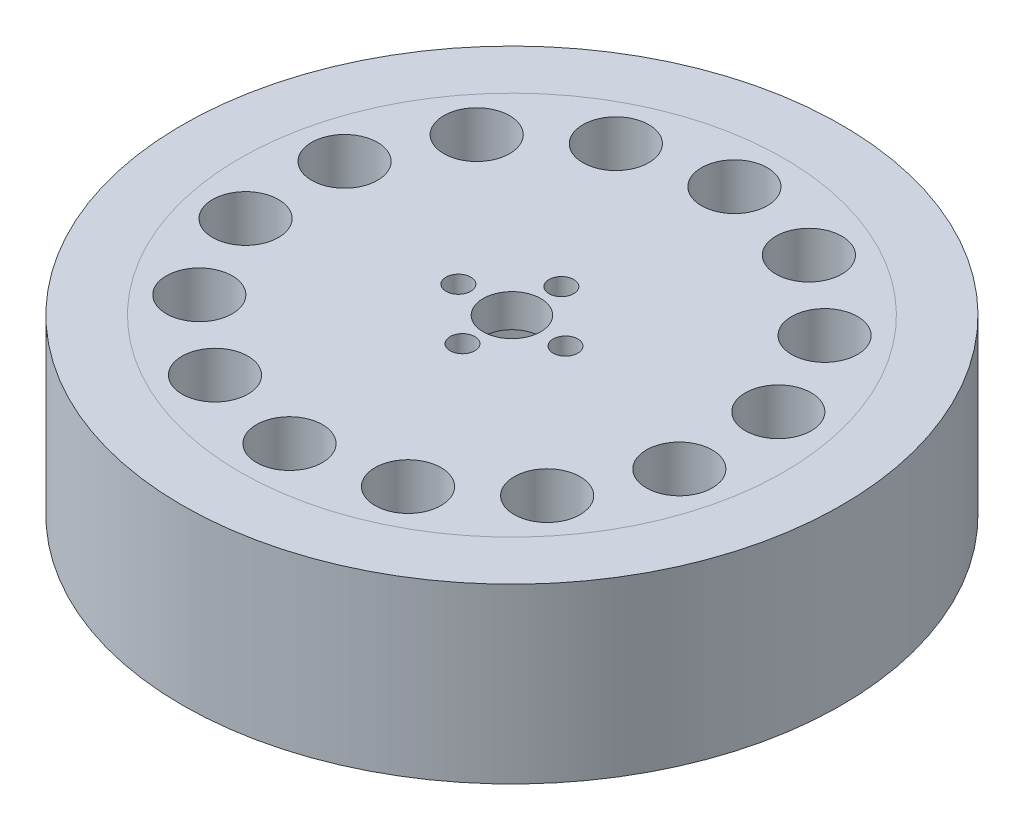
ISO-10303-21;
HEADER;
FILE_DESCRIPTION(('STEP AP214'),'2;1');
FILE_NAME('part.step','',(''),(''),'','','');
FILE_SCHEMA(('AUTOMOTIVE_DESIGN { 1 0 10303 214 1 1 1 1 }'));
ENDSEC;
DATA;
#1=APPLICATION_CONTEXT('core data for automotive mechanical design processes');
#2=APPLICATION_PROTOCOL_DEFINITION('international standard','automotive_design',2000,#1);
#3=PRODUCT_CONTEXT('',#1,'mechanical');
#4=PRODUCT('Part','Part','',(#3));
#5=PRODUCT_RELATED_PRODUCT_CATEGORY('part','',(#4));
#6=PRODUCT_DEFINITION_FORMATION('','',#4);
#7=PRODUCT_DEFINITION_CONTEXT('part definition',#1,'design');
#8=PRODUCT_DEFINITION('design','',#6,#7);
#9=PRODUCT_DEFINITION_SHAPE('','',#8);
#10=(LENGTH_UNIT() NAMED_UNIT(*) SI_UNIT(.MILLI.,.METRE.));
#11=(NAMED_UNIT(*) PLANE_ANGLE_UNIT() SI_UNIT($,.RADIAN.));
#12=(NAMED_UNIT(*) SI_UNIT($,.STERADIAN.) SOLID_ANGLE_UNIT());
#13=UNCERTAINTY_MEASURE_WITH_UNIT(LENGTH_MEASURE(1.E-05),#10,'distance_accuracy_value','');
#14=(GEOMETRIC_REPRESENTATION_CONTEXT(3) GLOBAL_UNCERTAINTY_ASSIGNED_CONTEXT((#13)) GLOBAL_UNIT_ASSIGNED_CONTEXT((#10,
#11,#12)) REPRESENTATION_CONTEXT('',''));
#15=CARTESIAN_POINT('',(0.,0.,0.));
#16=DIRECTION('',(0.,0.,1.));
#17=DIRECTION('',(1.,0.,0.));
#18=AXIS2_PLACEMENT_3D('',#15,#16,#17);
#19=CARTESIAN_POINT('',(0.,-10.5,0.));
#20=DIRECTION('',(0.,1.,0.));
#21=DIRECTION('',(0.,0.,1.));
#22=AXIS2_PLACEMENT_3D('',#19,#20,#21);
#23=CYLINDRICAL_SURFACE('',#22,40.);
#24=CARTESIAN_POINT('',(0.,-10.5,0.));
#25=DIRECTION('',(0.,1.,0.));
#26=DIRECTION('',(0.,0.,1.));
#27=AXIS2_PLACEMENT_3D('',#24,#25,#26);
#28=CIRCLE('',#27,40.);
#29=CARTESIAN_POINT('',(0.,-10.5,40.));
#30=VERTEX_POINT('',#29);
#31=EDGE_CURVE('E11',#30,#30,#28,.T.);
#32=ORIENTED_EDGE('',*,*,#31,.T.);
#33=EDGE_LOOP('',(#32));
#34=FACE_BOUND('',#33,.T.);
#35=CARTESIAN_POINT('',(0.,10.5,0.));
#36=DIRECTION('',(0.,1.,0.));
#37=DIRECTION('',(0.,0.,1.));
#38=AXIS2_PLACEMENT_3D('',#35,#36,#37);
#39=CIRCLE('',#38,40.);
#40=CARTESIAN_POINT('',(0.,10.5,40.));
#41=VERTEX_POINT('',#40);
#42=EDGE_CURVE('E47',#41,#41,#39,.T.);
#43=ORIENTED_EDGE('',*,*,#42,.F.);
#44=EDGE_LOOP('',(#43));
#45=FACE_BOUND('',#44,.T.);
#46=ADVANCED_FACE('F44',(#34,#45),#23,.T.);
#47=CARTESIAN_POINT('',(0.,-10.5,0.));
#48=DIRECTION('',(0.,1.,0.));
#49=DIRECTION('',(0.,0.,1.));
#50=AXIS2_PLACEMENT_3D('',#47,#48,#49);
#51=PLANE('',#50);
#52=CARTESIAN_POINT('',(0.,-10.5,0.));
#53=DIRECTION('',(0.,1.,0.));
#54=DIRECTION('',(0.,0.,1.));
#55=AXIS2_PLACEMENT_3D('',#52,#53,#54);
#56=CIRCLE('',#55,33.);
#57=CARTESIAN_POINT('',(0.,-10.5,33.));
#58=VERTEX_POINT('',#57);
#59=EDGE_CURVE('E54',#58,#58,#56,.T.);
#60=ORIENTED_EDGE('',*,*,#59,.T.);
#61=EDGE_LOOP('',(#60));
#62=FACE_BOUND('',#61,.T.);
#63=ORIENTED_EDGE('',*,*,#31,.F.);
#64=EDGE_LOOP('',(#63));
#65=FACE_BOUND('',#64,.T.);
#66=ADVANCED_FACE('F62',(#62,#65),#51,.F.);
#67=CARTESIAN_POINT('',(0.,10.5,0.));
#68=DIRECTION('',(0.,1.,0.));
#69=DIRECTION('',(0.,0.,1.));
#70=AXIS2_PLACEMENT_3D('',#67,#68,#69);
#71=PLANE('',#70);
#72=CARTESIAN_POINT('',(0.,10.5,0.));
#73=DIRECTION('',(0.,1.,0.));
#74=DIRECTION('',(0.,0.,1.));
#75=AXIS2_PLACEMENT_3D('',#72,#73,#74);
#76=CIRCLE('',#75,33.);
#77=CARTESIAN_POINT('',(0.,10.5,33.));
#78=VERTEX_POINT('',#77);
#79=EDGE_CURVE('E56',#78,#78,#76,.T.);
#80=ORIENTED_EDGE('',*,*,#79,.F.);
#81=EDGE_LOOP('',(#80));
#82=FACE_BOUND('',#81,.T.);
#83=ORIENTED_EDGE('',*,*,#42,.T.);
#84=EDGE_LOOP('',(#83));
#85=FACE_BOUND('',#84,.T.);
#86=ADVANCED_FACE('F68',(#82,#85),#71,.T.);
#87=CARTESIAN_POINT('',(0.,-10.5,0.));
#88=DIRECTION('',(0.,1.,0.));
#89=DIRECTION('',(0.,0.,1.));
#90=AXIS2_PLACEMENT_3D('',#87,#88,#89);
#91=CYLINDRICAL_SURFACE('',#90,33.);
#92=ORIENTED_EDGE('',*,*,#59,.F.);
#93=EDGE_LOOP('',(#92));
#94=FACE_BOUND('',#93,.T.);
#95=ORIENTED_EDGE('',*,*,#79,.T.);
#96=EDGE_LOOP('',(#95));
#97=FACE_BOUND('',#96,.T.);
#98=ADVANCED_FACE('F65',(#94,#97),#91,.F.);
#99=CLOSED_SHELL('',(#46,#66,#86,#98));
#100=MANIFOLD_SOLID_BREP('B2',#99);
#101=CARTESIAN_POINT('',(0.,10.5,0.));
#102=DIRECTION('',(0.,-1.,0.));
#103=DIRECTION('',(0.,0.,-1.));
#104=AXIS2_PLACEMENT_3D('',#101,#102,#103);
#105=CYLINDRICAL_SURFACE('',#104,21.);
#106=CARTESIAN_POINT('',(0.,-10.5,0.));
#107=DIRECTION('',(0.,1.,0.));
#108=DIRECTION('',(0.,0.,1.));
#109=AXIS2_PLACEMENT_3D('',#106,#107,#108);
#110=CIRCLE('',#109,21.);
#111=CARTESIAN_POINT('',(0.,-10.5,21.));
#112=VERTEX_POINT('',#111);
#113=EDGE_CURVE('E118',#112,#112,#110,.T.);
#114=ORIENTED_EDGE('',*,*,#113,.F.);
#115=EDGE_LOOP('',(#114));
#116=FACE_BOUND('',#115,.T.);
#117=CARTESIAN_POINT('',(0.,6.50000000000001,0.));
#118=DIRECTION('',(0.,1.,0.));
#119=DIRECTION('',(0.,0.,1.));
#120=AXIS2_PLACEMENT_3D('',#117,#118,#119);
#121=CIRCLE('',#120,21.);
#122=CARTESIAN_POINT('',(0.,6.50000000000001,21.));
#123=VERTEX_POINT('',#122);
#124=EDGE_CURVE('E215',#123,#123,#121,.F.);
#125=ORIENTED_EDGE('',*,*,#124,.F.);
#126=EDGE_LOOP('',(#125));
#127=FACE_BOUND('',#126,.T.);
#128=ADVANCED_FACE('F107',(#116,#127),#105,.F.);
#129=CARTESIAN_POINT('',(0.,10.5,0.));
#130=DIRECTION('',(0.,1.,0.));
#131=DIRECTION('',(0.,0.,1.));
#132=AXIS2_PLACEMENT_3D('',#129,#130,#131);
#133=PLANE('',#132);
#134=CARTESIAN_POINT('',(-21.1094500266368,10.5,-16.8342246501858));
#135=DIRECTION('',(0.,1.,0.));
#136=DIRECTION('',(0.,0.,1.));
#137=AXIS2_PLACEMENT_3D('',#134,#135,#136);
#138=CIRCLE('',#137,4.);
#139=CARTESIAN_POINT('',(-21.1094500266368,10.5,-12.8342246501858));
#140=VERTEX_POINT('',#139);
#141=EDGE_CURVE('E192',#140,#140,#138,.T.);
#142=ORIENTED_EDGE('',*,*,#141,.F.);
#143=EDGE_LOOP('',(#142));
#144=FACE_BOUND('',#143,.T.);
#145=CARTESIAN_POINT('',(-26.3230536289092,10.5,6.00806521682049));
#146=DIRECTION('',(0.,1.,0.));
#147=DIRECTION('',(0.,0.,1.));
#148=AXIS2_PLACEMENT_3D('',#145,#146,#147);
#149=CIRCLE('',#148,4.);
#150=CARTESIAN_POINT('',(-26.3230536289092,10.5,10.0080652168205));
#151=VERTEX_POINT('',#150);
#152=EDGE_CURVE('E180',#151,#151,#149,.T.);
#153=ORIENTED_EDGE('',*,*,#152,.F.);
#154=EDGE_LOOP('',(#153));
#155=FACE_BOUND('',#154,.T.);
#156=CARTESIAN_POINT('',(-11.7148609561741,10.5,24.3261594333653));
#157=DIRECTION('',(0.,1.,0.));
#158=DIRECTION('',(0.,0.,1.));
#159=AXIS2_PLACEMENT_3D('',#156,#157,#158);
#160=CIRCLE('',#159,4.);
#161=CARTESIAN_POINT('',(-11.7148609561741,10.5,28.3261594333653));
#162=VERTEX_POINT('',#161);
#163=EDGE_CURVE('E168',#162,#162,#160,.T.);
#164=ORIENTED_EDGE('',*,*,#163,.F.);
#165=EDGE_LOOP('',(#164));
#166=FACE_BOUND('',#165,.T.);
#167=CARTESIAN_POINT('',(11.7148609561741,10.5,24.3261594333653));
#168=DIRECTION('',(0.,1.,0.));
#169=DIRECTION('',(0.,0.,1.));
#170=AXIS2_PLACEMENT_3D('',#167,#168,#169);
#171=CIRCLE('',#170,4.);
#172=CARTESIAN_POINT('',(11.7148609561741,10.5,28.3261594333653));
#173=VERTEX_POINT('',#172);
#174=EDGE_CURVE('E156',#173,#173,#171,.T.);
#175=ORIENTED_EDGE('',*,*,#174,.F.);
#176=EDGE_LOOP('',(#175));
#177=FACE_BOUND('',#176,.T.);
#178=CARTESIAN_POINT('',(26.3230536289092,10.5,6.00806521682049));
#179=DIRECTION('',(0.,1.,0.));
#180=DIRECTION('',(0.,0.,1.));
#181=AXIS2_PLACEMENT_3D('',#178,#179,#180);
#182=CIRCLE('',#181,4.);
#183=CARTESIAN_POINT('',(26.3230536289092,10.5,10.0080652168205));
#184=VERTEX_POINT('',#183);
#185=EDGE_CURVE('E144',#184,#184,#182,.T.);
#186=ORIENTED_EDGE('',*,*,#185,.F.);
#187=EDGE_LOOP('',(#186));
#188=FACE_BOUND('',#187,.T.);
#189=CARTESIAN_POINT('',(21.1094500266368,10.5,-16.8342246501858));
#190=DIRECTION('',(0.,1.,0.));
#191=DIRECTION('',(0.,0.,1.));
#192=AXIS2_PLACEMENT_3D('',#189,#190,#191);
#193=CIRCLE('',#192,4.);
#194=CARTESIAN_POINT('',(21.1094500266368,10.5,-12.8342246501858));
#195=VERTEX_POINT('',#194);
#196=EDGE_CURVE('E132',#195,#195,#193,.T.);
#197=ORIENTED_EDGE('',*,*,#196,.F.);
#198=EDGE_LOOP('',(#197));
#199=FACE_BOUND('',#198,.T.);
#200=CARTESIAN_POINT('',(0.,10.5,-27.));
#201=DIRECTION('',(0.,1.,0.));
#202=DIRECTION('',(0.,0.,1.));
#203=AXIS2_PLACEMENT_3D('',#200,#201,#202);
#204=CIRCLE('',#203,4.);
#205=CARTESIAN_POINT('',(0.,10.5,-23.));
#206=VERTEX_POINT('',#205);
#207=EDGE_CURVE('E122',#206,#206,#204,.T.);
#208=ORIENTED_EDGE('',*,*,#207,.F.);
#209=EDGE_LOOP('',(#208));
#210=FACE_BOUND('',#209,.T.);
#211=CARTESIAN_POINT('',(0.,10.5,0.));
#212=DIRECTION('',(0.,1.,0.));
#213=DIRECTION('',(0.,0.,1.));
#214=AXIS2_PLACEMENT_3D('',#211,#212,#213);
#215=CIRCLE('',#214,33.);
#216=CARTESIAN_POINT('',(0.,10.5,33.));
#217=VERTEX_POINT('',#216);
#218=EDGE_CURVE('E43',#217,#217,#215,.T.);
#219=ORIENTED_EDGE('',*,*,#218,.T.);
#220=EDGE_LOOP('',(#219));
#221=FACE_BOUND('',#220,.T.);
#222=CARTESIAN_POINT('',(11.7148609561741,10.5,-24.3261594333653));
#223=DIRECTION('',(0.,1.,0.));
#224=DIRECTION('',(0.,0.,1.));
#225=AXIS2_PLACEMENT_3D('',#222,#223,#224);
#226=CIRCLE('',#225,4.);
#227=CARTESIAN_POINT('',(11.7148609561741,10.5,-20.3261594333653));
#228=VERTEX_POINT('',#227);
#229=EDGE_CURVE('E126',#228,#228,#226,.T.);
#230=ORIENTED_EDGE('',*,*,#229,.F.);
#231=EDGE_LOOP('',(#230));
#232=FACE_BOUND('',#231,.T.);
#233=CARTESIAN_POINT('',(26.3230536289092,10.5,-6.00806521682049));
#234=DIRECTION('',(0.,1.,0.));
#235=DIRECTION('',(0.,0.,1.));
#236=AXIS2_PLACEMENT_3D('',#233,#234,#235);
#237=CIRCLE('',#236,4.);
#238=CARTESIAN_POINT('',(26.3230536289092,10.5,-2.00806521682049));
#239=VERTEX_POINT('',#238);
#240=EDGE_CURVE('E138',#239,#239,#237,.T.);
#241=ORIENTED_EDGE('',*,*,#240,.F.);
#242=EDGE_LOOP('',(#241));
#243=FACE_BOUND('',#242,.T.);
#244=CARTESIAN_POINT('',(21.1094500266368,10.5,16.8342246501858));
#245=DIRECTION('',(0.,1.,0.));
#246=DIRECTION('',(0.,0.,1.));
#247=AXIS2_PLACEMENT_3D('',#244,#245,#246);
#248=CIRCLE('',#247,3.99999999999999);
#249=CARTESIAN_POINT('',(21.1094500266368,10.5,20.8342246501858));
#250=VERTEX_POINT('',#249);
#251=EDGE_CURVE('E150',#250,#250,#248,.T.);
#252=ORIENTED_EDGE('',*,*,#251,.F.);
#253=EDGE_LOOP('',(#252));
#254=FACE_BOUND('',#253,.T.);
#255=CARTESIAN_POINT('',(0.,10.5,27.));
#256=DIRECTION('',(0.,1.,0.));
#257=DIRECTION('',(0.,0.,1.));
#258=AXIS2_PLACEMENT_3D('',#255,#256,#257);
#259=CIRCLE('',#258,4.);
#260=CARTESIAN_POINT('',(0.,10.5,31.));
#261=VERTEX_POINT('',#260);
#262=EDGE_CURVE('E162',#261,#261,#259,.T.);
#263=ORIENTED_EDGE('',*,*,#262,.F.);
#264=EDGE_LOOP('',(#263));
#265=FACE_BOUND('',#264,.T.);
#266=CARTESIAN_POINT('',(-21.1094500266368,10.5,16.8342246501858));
#267=DIRECTION('',(0.,1.,0.));
#268=DIRECTION('',(0.,0.,1.));
#269=AXIS2_PLACEMENT_3D('',#266,#267,#268);
#270=CIRCLE('',#269,4.);
#271=CARTESIAN_POINT('',(-21.1094500266368,10.5,20.8342246501858));
#272=VERTEX_POINT('',#271);
#273=EDGE_CURVE('E174',#272,#272,#270,.T.);
#274=ORIENTED_EDGE('',*,*,#273,.F.);
#275=EDGE_LOOP('',(#274));
#276=FACE_BOUND('',#275,.T.);
#277=CARTESIAN_POINT('',(-26.3230536289092,10.5,-6.00806521682048));
#278=DIRECTION('',(0.,1.,0.));
#279=DIRECTION('',(0.,0.,1.));
#280=AXIS2_PLACEMENT_3D('',#277,#278,#279);
#281=CIRCLE('',#280,4.);
#282=CARTESIAN_POINT('',(-26.3230536289092,10.5,-2.00806521682048));
#283=VERTEX_POINT('',#282);
#284=EDGE_CURVE('E186',#283,#283,#281,.T.);
#285=ORIENTED_EDGE('',*,*,#284,.F.);
#286=EDGE_LOOP('',(#285));
#287=FACE_BOUND('',#286,.T.);
#288=CARTESIAN_POINT('',(-11.7148609561741,10.5,-24.3261594333653));
#289=DIRECTION('',(0.,1.,0.));
#290=DIRECTION('',(0.,0.,1.));
#291=AXIS2_PLACEMENT_3D('',#288,#289,#290);
#292=CIRCLE('',#291,4.);
#293=CARTESIAN_POINT('',(-11.7148609561741,10.5,-20.3261594333653));
#294=VERTEX_POINT('',#293);
#295=EDGE_CURVE('E198',#294,#294,#292,.T.);
#296=ORIENTED_EDGE('',*,*,#295,.F.);
#297=EDGE_LOOP('',(#296));
#298=FACE_BOUND('',#297,.T.);
#299=CARTESIAN_POINT('',(0.,10.5,0.));
#300=DIRECTION('',(0.,1.,0.));
#301=DIRECTION('',(0.,0.,1.));
#302=AXIS2_PLACEMENT_3D('',#299,#300,#301);
#303=CIRCLE('',#302,3.5);
#304=CARTESIAN_POINT('',(0.,10.5,3.5));
#305=VERTEX_POINT('',#304);
#306=EDGE_CURVE('E225',#305,#305,#303,.T.);
#307=ORIENTED_EDGE('',*,*,#306,.F.);
#308=EDGE_LOOP('',(#307));
#309=FACE_BOUND('',#308,.T.);
#310=CARTESIAN_POINT('',(6.5,10.5,0.));
#311=DIRECTION('',(0.,1.,0.));
#312=DIRECTION('',(0.,0.,1.));
#313=AXIS2_PLACEMENT_3D('',#310,#311,#312);
#314=CIRCLE('',#313,1.5);
#315=CARTESIAN_POINT('',(6.5,10.5,1.5));
#316=VERTEX_POINT('',#315);
#317=EDGE_CURVE('E222',#316,#316,#314,.T.);
#318=ORIENTED_EDGE('',*,*,#317,.F.);
#319=EDGE_LOOP('',(#318));
#320=FACE_BOUND('',#319,.T.);
#321=CARTESIAN_POINT('',(-6.5,10.5,0.));
#322=DIRECTION('',(0.,1.,0.));
#323=DIRECTION('',(0.,0.,1.));
#324=AXIS2_PLACEMENT_3D('',#321,#322,#323);
#325=CIRCLE('',#324,1.5);
#326=CARTESIAN_POINT('',(-6.5,10.5,1.5));
#327=VERTEX_POINT('',#326);
#328=EDGE_CURVE('E219',#327,#327,#325,.T.);
#329=ORIENTED_EDGE('',*,*,#328,.F.);
#330=EDGE_LOOP('',(#329));
#331=FACE_BOUND('',#330,.T.);
#332=CARTESIAN_POINT('',(0.,10.5,6.));
#333=DIRECTION('',(0.,1.,0.));
#334=DIRECTION('',(0.,0.,1.));
#335=AXIS2_PLACEMENT_3D('',#332,#333,#334);
#336=CIRCLE('',#335,1.5);
#337=CARTESIAN_POINT('',(0.,10.5,7.5));
#338=VERTEX_POINT('',#337);
#339=EDGE_CURVE('E216',#338,#338,#336,.T.);
#340=ORIENTED_EDGE('',*,*,#339,.F.);
#341=EDGE_LOOP('',(#340));
#342=FACE_BOUND('',#341,.T.);
#343=CARTESIAN_POINT('',(0.,10.5,-6.));
#344=DIRECTION('',(0.,1.,0.));
#345=DIRECTION('',(0.,0.,1.));
#346=AXIS2_PLACEMENT_3D('',#343,#344,#345);
#347=CIRCLE('',#346,1.5);
#348=CARTESIAN_POINT('',(0.,10.5,-4.5));
#349=VERTEX_POINT('',#348);
#350=EDGE_CURVE('E212',#349,#349,#347,.T.);
#351=ORIENTED_EDGE('',*,*,#350,.F.);
#352=EDGE_LOOP('',(#351));
#353=FACE_BOUND('',#352,.T.);
#354=ADVANCED_FACE('F263',(#144,#155,#166,#177,#188,#199,#210,#221,#232,#243,#254,#265,#276,
#287,#298,#309,#320,#331,#342,#353),#133,.T.);
#355=CARTESIAN_POINT('',(0.,-10.5,0.));
#356=DIRECTION('',(0.,1.,0.));
#357=DIRECTION('',(0.,0.,1.));
#358=AXIS2_PLACEMENT_3D('',#355,#356,#357);
#359=PLANE('',#358);
#360=CARTESIAN_POINT('',(0.,-10.5,0.));
#361=DIRECTION('',(0.,1.,0.));
#362=DIRECTION('',(0.,0.,1.));
#363=AXIS2_PLACEMENT_3D('',#360,#361,#362);
#364=CIRCLE('',#363,33.);
#365=CARTESIAN_POINT('',(0.,-10.5,33.));
#366=VERTEX_POINT('',#365);
#367=EDGE_CURVE('E111',#366,#366,#364,.T.);
#368=ORIENTED_EDGE('',*,*,#367,.F.);
#369=EDGE_LOOP('',(#368));
#370=FACE_BOUND('',#369,.T.);
#371=ORIENTED_EDGE('',*,*,#113,.T.);
#372=EDGE_LOOP('',(#371));
#373=FACE_BOUND('',#372,.T.);
#374=CARTESIAN_POINT('',(0.,-10.5,-27.));
#375=DIRECTION('',(0.,1.,0.));
#376=DIRECTION('',(0.,0.,1.));
#377=AXIS2_PLACEMENT_3D('',#374,#375,#376);
#378=CIRCLE('',#377,4.);
#379=CARTESIAN_POINT('',(0.,-10.5,-23.));
#380=VERTEX_POINT('',#379);
#381=EDGE_CURVE('E123',#380,#380,#378,.T.);
#382=ORIENTED_EDGE('',*,*,#381,.T.);
#383=EDGE_LOOP('',(#382));
#384=FACE_BOUND('',#383,.T.);
#385=CARTESIAN_POINT('',(11.7148609561741,-10.5,-24.3261594333653));
#386=DIRECTION('',(0.,1.,0.));
#387=DIRECTION('',(0.,0.,1.));
#388=AXIS2_PLACEMENT_3D('',#385,#386,#387);
#389=CIRCLE('',#388,4.);
#390=CARTESIAN_POINT('',(11.7148609561741,-10.5,-20.3261594333653));
#391=VERTEX_POINT('',#390);
#392=EDGE_CURVE('E129',#391,#391,#389,.T.);
#393=ORIENTED_EDGE('',*,*,#392,.T.);
#394=EDGE_LOOP('',(#393));
#395=FACE_BOUND('',#394,.T.);
#396=CARTESIAN_POINT('',(21.1094500266368,-10.5,-16.8342246501858));
#397=DIRECTION('',(0.,1.,0.));
#398=DIRECTION('',(0.,0.,1.));
#399=AXIS2_PLACEMENT_3D('',#396,#397,#398);
#400=CIRCLE('',#399,4.);
#401=CARTESIAN_POINT('',(21.1094500266368,-10.5,-12.8342246501858));
#402=VERTEX_POINT('',#401);
#403=EDGE_CURVE('E135',#402,#402,#400,.T.);
#404=ORIENTED_EDGE('',*,*,#403,.T.);
#405=EDGE_LOOP('',(#404));
#406=FACE_BOUND('',#405,.T.);
#407=CARTESIAN_POINT('',(26.3230536289092,-10.5,-6.00806521682049));
#408=DIRECTION('',(0.,1.,0.));
#409=DIRECTION('',(0.,0.,1.));
#410=AXIS2_PLACEMENT_3D('',#407,#408,#409);
#411=CIRCLE('',#410,4.);
#412=CARTESIAN_POINT('',(26.3230536289092,-10.5,-2.00806521682049));
#413=VERTEX_POINT('',#412);
#414=EDGE_CURVE('E141',#413,#413,#411,.T.);
#415=ORIENTED_EDGE('',*,*,#414,.T.);
#416=EDGE_LOOP('',(#415));
#417=FACE_BOUND('',#416,.T.);
#418=CARTESIAN_POINT('',(26.3230536289092,-10.5,6.00806521682049));
#419=DIRECTION('',(0.,1.,0.));
#420=DIRECTION('',(0.,0.,1.));
#421=AXIS2_PLACEMENT_3D('',#418,#419,#420);
#422=CIRCLE('',#421,4.);
#423=CARTESIAN_POINT('',(26.3230536289092,-10.5,10.0080652168205));
#424=VERTEX_POINT('',#423);
#425=EDGE_CURVE('E147',#424,#424,#422,.T.);
#426=ORIENTED_EDGE('',*,*,#425,.T.);
#427=EDGE_LOOP('',(#426));
#428=FACE_BOUND('',#427,.T.);
#429=CARTESIAN_POINT('',(21.1094500266368,-10.5,16.8342246501858));
#430=DIRECTION('',(0.,1.,0.));
#431=DIRECTION('',(0.,0.,1.));
#432=AXIS2_PLACEMENT_3D('',#429,#430,#431);
#433=CIRCLE('',#432,3.99999999999999);
#434=CARTESIAN_POINT('',(21.1094500266368,-10.5,20.8342246501858));
#435=VERTEX_POINT('',#434);
#436=EDGE_CURVE('E153',#435,#435,#433,.T.);
#437=ORIENTED_EDGE('',*,*,#436,.T.);
#438=EDGE_LOOP('',(#437));
#439=FACE_BOUND('',#438,.T.);
#440=CARTESIAN_POINT('',(11.7148609561741,-10.5,24.3261594333653));
#441=DIRECTION('',(0.,1.,0.));
#442=DIRECTION('',(0.,0.,1.));
#443=AXIS2_PLACEMENT_3D('',#440,#441,#442);
#444=CIRCLE('',#443,4.);
#445=CARTESIAN_POINT('',(11.7148609561741,-10.5,28.3261594333653));
#446=VERTEX_POINT('',#445);
#447=EDGE_CURVE('E159',#446,#446,#444,.T.);
#448=ORIENTED_EDGE('',*,*,#447,.T.);
#449=EDGE_LOOP('',(#448));
#450=FACE_BOUND('',#449,.T.);
#451=CARTESIAN_POINT('',(0.,-10.5,27.));
#452=DIRECTION('',(0.,1.,0.));
#453=DIRECTION('',(0.,0.,1.));
#454=AXIS2_PLACEMENT_3D('',#451,#452,#453);
#455=CIRCLE('',#454,4.);
#456=CARTESIAN_POINT('',(0.,-10.5,31.));
#457=VERTEX_POINT('',#456);
#458=EDGE_CURVE('E165',#457,#457,#455,.T.);
#459=ORIENTED_EDGE('',*,*,#458,.T.);
#460=EDGE_LOOP('',(#459));
#461=FACE_BOUND('',#460,.T.);
#462=CARTESIAN_POINT('',(-11.7148609561741,-10.5,24.3261594333653));
#463=DIRECTION('',(0.,1.,0.));
#464=DIRECTION('',(0.,0.,1.));
#465=AXIS2_PLACEMENT_3D('',#462,#463,#464);
#466=CIRCLE('',#465,4.);
#467=CARTESIAN_POINT('',(-11.7148609561741,-10.5,28.3261594333653));
#468=VERTEX_POINT('',#467);
#469=EDGE_CURVE('E171',#468,#468,#466,.T.);
#470=ORIENTED_EDGE('',*,*,#469,.T.);
#471=EDGE_LOOP('',(#470));
#472=FACE_BOUND('',#471,.T.);
#473=CARTESIAN_POINT('',(-21.1094500266368,-10.5,16.8342246501858));
#474=DIRECTION('',(0.,1.,0.));
#475=DIRECTION('',(0.,0.,1.));
#476=AXIS2_PLACEMENT_3D('',#473,#474,#475);
#477=CIRCLE('',#476,4.);
#478=CARTESIAN_POINT('',(-21.1094500266368,-10.5,20.8342246501858));
#479=VERTEX_POINT('',#478);
#480=EDGE_CURVE('E177',#479,#479,#477,.T.);
#481=ORIENTED_EDGE('',*,*,#480,.T.);
#482=EDGE_LOOP('',(#481));
#483=FACE_BOUND('',#482,.T.);
#484=CARTESIAN_POINT('',(-26.3230536289092,-10.5,6.00806521682049));
#485=DIRECTION('',(0.,1.,0.));
#486=DIRECTION('',(0.,0.,1.));
#487=AXIS2_PLACEMENT_3D('',#484,#485,#486);
#488=CIRCLE('',#487,4.);
#489=CARTESIAN_POINT('',(-26.3230536289092,-10.5,10.0080652168205));
#490=VERTEX_POINT('',#489);
#491=EDGE_CURVE('E183',#490,#490,#488,.T.);
#492=ORIENTED_EDGE('',*,*,#491,.T.);
#493=EDGE_LOOP('',(#492));
#494=FACE_BOUND('',#493,.T.);
#495=CARTESIAN_POINT('',(-26.3230536289092,-10.5,-6.00806521682048));
#496=DIRECTION('',(0.,1.,0.));
#497=DIRECTION('',(0.,0.,1.));
#498=AXIS2_PLACEMENT_3D('',#495,#496,#497);
#499=CIRCLE('',#498,4.);
#500=CARTESIAN_POINT('',(-26.3230536289092,-10.5,-2.00806521682048));
#501=VERTEX_POINT('',#500);
#502=EDGE_CURVE('E189',#501,#501,#499,.T.);
#503=ORIENTED_EDGE('',*,*,#502,.T.);
#504=EDGE_LOOP('',(#503));
#505=FACE_BOUND('',#504,.T.);
#506=CARTESIAN_POINT('',(-21.1094500266368,-10.5,-16.8342246501858));
#507=DIRECTION('',(0.,1.,0.));
#508=DIRECTION('',(0.,0.,1.));
#509=AXIS2_PLACEMENT_3D('',#506,#507,#508);
#510=CIRCLE('',#509,4.);
#511=CARTESIAN_POINT('',(-21.1094500266368,-10.5,-12.8342246501858));
#512=VERTEX_POINT('',#511);
#513=EDGE_CURVE('E195',#512,#512,#510,.T.);
#514=ORIENTED_EDGE('',*,*,#513,.T.);
#515=EDGE_LOOP('',(#514));
#516=FACE_BOUND('',#515,.T.);
#517=CARTESIAN_POINT('',(-11.7148609561741,-10.5,-24.3261594333653));
#518=DIRECTION('',(0.,1.,0.));
#519=DIRECTION('',(0.,0.,1.));
#520=AXIS2_PLACEMENT_3D('',#517,#518,#519);
#521=CIRCLE('',#520,4.);
#522=CARTESIAN_POINT('',(-11.7148609561741,-10.5,-20.3261594333653));
#523=VERTEX_POINT('',#522);
#524=EDGE_CURVE('E201',#523,#523,#521,.T.);
#525=ORIENTED_EDGE('',*,*,#524,.T.);
#526=EDGE_LOOP('',(#525));
#527=FACE_BOUND('',#526,.T.);
#528=ADVANCED_FACE('F265',(#370,#373,#384,#395,#406,#417,#428,#439,#450,#461,#472,#483,#494,
#505,#516,#527),#359,.F.);
#529=CARTESIAN_POINT('',(0.,10.5,0.));
#530=DIRECTION('',(0.,-1.,0.));
#531=DIRECTION('',(0.,0.,-1.));
#532=AXIS2_PLACEMENT_3D('',#529,#530,#531);
#533=CYLINDRICAL_SURFACE('',#532,33.);
#534=ORIENTED_EDGE('',*,*,#218,.F.);
#535=EDGE_LOOP('',(#534));
#536=FACE_BOUND('',#535,.T.);
#537=ORIENTED_EDGE('',*,*,#367,.T.);
#538=EDGE_LOOP('',(#537));
#539=FACE_BOUND('',#538,.T.);
#540=ADVANCED_FACE('F109',(#536,#539),#533,.T.);
#541=CARTESIAN_POINT('',(0.,10.5,-27.));
#542=DIRECTION('',(0.,-1.,0.));
#543=DIRECTION('',(0.,0.,-1.));
#544=AXIS2_PLACEMENT_3D('',#541,#542,#543);
#545=CYLINDRICAL_SURFACE('',#544,4.);
#546=ORIENTED_EDGE('',*,*,#207,.T.);
#547=EDGE_LOOP('',(#546));
#548=FACE_BOUND('',#547,.T.);
#549=ORIENTED_EDGE('',*,*,#381,.F.);
#550=EDGE_LOOP('',(#549));
#551=FACE_BOUND('',#550,.T.);
#552=ADVANCED_FACE('F278',(#548,#551),#545,.F.);
#553=CARTESIAN_POINT('',(11.7148609561741,10.5,-24.3261594333653));
#554=DIRECTION('',(0.,-1.,0.));
#555=DIRECTION('',(0.,0.,-1.));
#556=AXIS2_PLACEMENT_3D('',#553,#554,#555);
#557=CYLINDRICAL_SURFACE('',#556,4.);
#558=ORIENTED_EDGE('',*,*,#229,.T.);
#559=EDGE_LOOP('',(#558));
#560=FACE_BOUND('',#559,.T.);
#561=ORIENTED_EDGE('',*,*,#392,.F.);
#562=EDGE_LOOP('',(#561));
#563=FACE_BOUND('',#562,.T.);
#564=ADVANCED_FACE('F281',(#560,#563),#557,.F.);
#565=CARTESIAN_POINT('',(21.1094500266368,10.5,-16.8342246501858));
#566=DIRECTION('',(0.,-1.,0.));
#567=DIRECTION('',(0.,0.,-1.));
#568=AXIS2_PLACEMENT_3D('',#565,#566,#567);
#569=CYLINDRICAL_SURFACE('',#568,4.);
#570=ORIENTED_EDGE('',*,*,#196,.T.);
#571=EDGE_LOOP('',(#570));
#572=FACE_BOUND('',#571,.T.);
#573=ORIENTED_EDGE('',*,*,#403,.F.);
#574=EDGE_LOOP('',(#573));
#575=FACE_BOUND('',#574,.T.);
#576=ADVANCED_FACE('F285',(#572,#575),#569,.F.);
#577=CARTESIAN_POINT('',(26.3230536289092,10.5,-6.00806521682049));
#578=DIRECTION('',(0.,-1.,0.));
#579=DIRECTION('',(0.,0.,-1.));
#580=AXIS2_PLACEMENT_3D('',#577,#578,#579);
#581=CYLINDRICAL_SURFACE('',#580,4.);
#582=ORIENTED_EDGE('',*,*,#240,.T.);
#583=EDGE_LOOP('',(#582));
#584=FACE_BOUND('',#583,.T.);
#585=ORIENTED_EDGE('',*,*,#414,.F.);
#586=EDGE_LOOP('',(#585));
#587=FACE_BOUND('',#586,.T.);
#588=ADVANCED_FACE('F289',(#584,#587),#581,.F.);
#589=CARTESIAN_POINT('',(26.3230536289092,10.5,6.00806521682049));
#590=DIRECTION('',(0.,-1.,0.));
#591=DIRECTION('',(0.,0.,-1.));
#592=AXIS2_PLACEMENT_3D('',#589,#590,#591);
#593=CYLINDRICAL_SURFACE('',#592,4.);
#594=ORIENTED_EDGE('',*,*,#185,.T.);
#595=EDGE_LOOP('',(#594));
#596=FACE_BOUND('',#595,.T.);
#597=ORIENTED_EDGE('',*,*,#425,.F.);
#598=EDGE_LOOP('',(#597));
#599=FACE_BOUND('',#598,.T.);
#600=ADVANCED_FACE('F293',(#596,#599),#593,.F.);
#601=CARTESIAN_POINT('',(21.1094500266368,10.5,16.8342246501858));
#602=DIRECTION('',(0.,-1.,0.));
#603=DIRECTION('',(0.,0.,-1.));
#604=AXIS2_PLACEMENT_3D('',#601,#602,#603);
#605=CYLINDRICAL_SURFACE('',#604,3.99999999999999);
#606=ORIENTED_EDGE('',*,*,#251,.T.);
#607=EDGE_LOOP('',(#606));
#608=FACE_BOUND('',#607,.T.);
#609=ORIENTED_EDGE('',*,*,#436,.F.);
#610=EDGE_LOOP('',(#609));
#611=FACE_BOUND('',#610,.T.);
#612=ADVANCED_FACE('F297',(#608,#611),#605,.F.);
#613=CARTESIAN_POINT('',(11.7148609561741,10.5,24.3261594333653));
#614=DIRECTION('',(0.,-1.,0.));
#615=DIRECTION('',(0.,0.,-1.));
#616=AXIS2_PLACEMENT_3D('',#613,#614,#615);
#617=CYLINDRICAL_SURFACE('',#616,4.);
#618=ORIENTED_EDGE('',*,*,#174,.T.);
#619=EDGE_LOOP('',(#618));
#620=FACE_BOUND('',#619,.T.);
#621=ORIENTED_EDGE('',*,*,#447,.F.);
#622=EDGE_LOOP('',(#621));
#623=FACE_BOUND('',#622,.T.);
#624=ADVANCED_FACE('F301',(#620,#623),#617,.F.);
#625=CARTESIAN_POINT('',(0.,10.5,27.));
#626=DIRECTION('',(0.,-1.,0.));
#627=DIRECTION('',(0.,0.,-1.));
#628=AXIS2_PLACEMENT_3D('',#625,#626,#627);
#629=CYLINDRICAL_SURFACE('',#628,4.);
#630=ORIENTED_EDGE('',*,*,#262,.T.);
#631=EDGE_LOOP('',(#630));
#632=FACE_BOUND('',#631,.T.);
#633=ORIENTED_EDGE('',*,*,#458,.F.);
#634=EDGE_LOOP('',(#633));
#635=FACE_BOUND('',#634,.T.);
#636=ADVANCED_FACE('F305',(#632,#635),#629,.F.);
#637=CARTESIAN_POINT('',(-11.7148609561741,10.5,24.3261594333653));
#638=DIRECTION('',(0.,-1.,0.));
#639=DIRECTION('',(0.,0.,-1.));
#640=AXIS2_PLACEMENT_3D('',#637,#638,#639);
#641=CYLINDRICAL_SURFACE('',#640,4.);
#642=ORIENTED_EDGE('',*,*,#163,.T.);
#643=EDGE_LOOP('',(#642));
#644=FACE_BOUND('',#643,.T.);
#645=ORIENTED_EDGE('',*,*,#469,.F.);
#646=EDGE_LOOP('',(#645));
#647=FACE_BOUND('',#646,.T.);
#648=ADVANCED_FACE('F309',(#644,#647),#641,.F.);
#649=CARTESIAN_POINT('',(-21.1094500266368,10.5,16.8342246501858));
#650=DIRECTION('',(0.,-1.,0.));
#651=DIRECTION('',(0.,0.,-1.));
#652=AXIS2_PLACEMENT_3D('',#649,#650,#651);
#653=CYLINDRICAL_SURFACE('',#652,4.);
#654=ORIENTED_EDGE('',*,*,#273,.T.);
#655=EDGE_LOOP('',(#654));
#656=FACE_BOUND('',#655,.T.);
#657=ORIENTED_EDGE('',*,*,#480,.F.);
#658=EDGE_LOOP('',(#657));
#659=FACE_BOUND('',#658,.T.);
#660=ADVANCED_FACE('F313',(#656,#659),#653,.F.);
#661=CARTESIAN_POINT('',(-26.3230536289092,10.5,6.00806521682049));
#662=DIRECTION('',(0.,-1.,0.));
#663=DIRECTION('',(0.,0.,-1.));
#664=AXIS2_PLACEMENT_3D('',#661,#662,#663);
#665=CYLINDRICAL_SURFACE('',#664,4.);
#666=ORIENTED_EDGE('',*,*,#152,.T.);
#667=EDGE_LOOP('',(#666));
#668=FACE_BOUND('',#667,.T.);
#669=ORIENTED_EDGE('',*,*,#491,.F.);
#670=EDGE_LOOP('',(#669));
#671=FACE_BOUND('',#670,.T.);
#672=ADVANCED_FACE('F317',(#668,#671),#665,.F.);
#673=CARTESIAN_POINT('',(-26.3230536289092,10.5,-6.00806521682048));
#674=DIRECTION('',(0.,-1.,0.));
#675=DIRECTION('',(0.,0.,-1.));
#676=AXIS2_PLACEMENT_3D('',#673,#674,#675);
#677=CYLINDRICAL_SURFACE('',#676,4.);
#678=ORIENTED_EDGE('',*,*,#284,.T.);
#679=EDGE_LOOP('',(#678));
#680=FACE_BOUND('',#679,.T.);
#681=ORIENTED_EDGE('',*,*,#502,.F.);
#682=EDGE_LOOP('',(#681));
#683=FACE_BOUND('',#682,.T.);
#684=ADVANCED_FACE('F321',(#680,#683),#677,.F.);
#685=CARTESIAN_POINT('',(-21.1094500266368,10.5,-16.8342246501858));
#686=DIRECTION('',(0.,-1.,0.));
#687=DIRECTION('',(0.,0.,-1.));
#688=AXIS2_PLACEMENT_3D('',#685,#686,#687);
#689=CYLINDRICAL_SURFACE('',#688,4.);
#690=ORIENTED_EDGE('',*,*,#141,.T.);
#691=EDGE_LOOP('',(#690));
#692=FACE_BOUND('',#691,.T.);
#693=ORIENTED_EDGE('',*,*,#513,.F.);
#694=EDGE_LOOP('',(#693));
#695=FACE_BOUND('',#694,.T.);
#696=ADVANCED_FACE('F325',(#692,#695),#689,.F.);
#697=CARTESIAN_POINT('',(-11.7148609561741,10.5,-24.3261594333653));
#698=DIRECTION('',(0.,-1.,0.));
#699=DIRECTION('',(0.,0.,-1.));
#700=AXIS2_PLACEMENT_3D('',#697,#698,#699);
#701=CYLINDRICAL_SURFACE('',#700,4.);
#702=ORIENTED_EDGE('',*,*,#295,.T.);
#703=EDGE_LOOP('',(#702));
#704=FACE_BOUND('',#703,.T.);
#705=ORIENTED_EDGE('',*,*,#524,.F.);
#706=EDGE_LOOP('',(#705));
#707=FACE_BOUND('',#706,.T.);
#708=ADVANCED_FACE('F259',(#704,#707),#701,.F.);
#709=CARTESIAN_POINT('',(0.,-69.89696961967,-6.));
#710=DIRECTION('',(0.,1.,0.));
#711=DIRECTION('',(0.,0.,1.));
#712=AXIS2_PLACEMENT_3D('',#709,#710,#711);
#713=CYLINDRICAL_SURFACE('',#712,1.5);
#714=CARTESIAN_POINT('',(0.,6.50000000000001,-6.));
#715=DIRECTION('',(0.,1.,0.));
#716=DIRECTION('',(0.,0.,1.));
#717=AXIS2_PLACEMENT_3D('',#714,#715,#716);
#718=CIRCLE('',#717,1.5);
#719=CARTESIAN_POINT('',(0.,6.50000000000001,-4.5));
#720=VERTEX_POINT('',#719);
#721=EDGE_CURVE('E204',#720,#720,#718,.F.);
#722=ORIENTED_EDGE('',*,*,#721,.T.);
#723=EDGE_LOOP('',(#722));
#724=FACE_BOUND('',#723,.T.);
#725=ORIENTED_EDGE('',*,*,#350,.T.);
#726=EDGE_LOOP('',(#725));
#727=FACE_BOUND('',#726,.T.);
#728=ADVANCED_FACE('F255',(#724,#727),#713,.F.);
#729=CARTESIAN_POINT('',(0.,-69.89696961967,6.));
#730=DIRECTION('',(0.,1.,0.));
#731=DIRECTION('',(0.,0.,1.));
#732=AXIS2_PLACEMENT_3D('',#729,#730,#731);
#733=CYLINDRICAL_SURFACE('',#732,1.5);
#734=CARTESIAN_POINT('',(0.,6.50000000000001,6.));
#735=DIRECTION('',(0.,1.,0.));
#736=DIRECTION('',(0.,0.,1.));
#737=AXIS2_PLACEMENT_3D('',#734,#735,#736);
#738=CIRCLE('',#737,1.5);
#739=CARTESIAN_POINT('',(0.,6.50000000000001,7.5));
#740=VERTEX_POINT('',#739);
#741=EDGE_CURVE('E230',#740,#740,#738,.F.);
#742=ORIENTED_EDGE('',*,*,#741,.T.);
#743=EDGE_LOOP('',(#742));
#744=FACE_BOUND('',#743,.T.);
#745=ORIENTED_EDGE('',*,*,#339,.T.);
#746=EDGE_LOOP('',(#745));
#747=FACE_BOUND('',#746,.T.);
#748=ADVANCED_FACE('F258',(#744,#747),#733,.F.);
#749=CARTESIAN_POINT('',(-6.5,-69.89696961967,0.));
#750=DIRECTION('',(0.,1.,0.));
#751=DIRECTION('',(0.,0.,1.));
#752=AXIS2_PLACEMENT_3D('',#749,#750,#751);
#753=CYLINDRICAL_SURFACE('',#752,1.5);
#754=CARTESIAN_POINT('',(-6.5,6.50000000000001,0.));
#755=DIRECTION('',(0.,1.,0.));
#756=DIRECTION('',(0.,0.,1.));
#757=AXIS2_PLACEMENT_3D('',#754,#755,#756);
#758=CIRCLE('',#757,1.5);
#759=CARTESIAN_POINT('',(-6.5,6.50000000000001,1.5));
#760=VERTEX_POINT('',#759);
#761=EDGE_CURVE('E210',#760,#760,#758,.F.);
#762=ORIENTED_EDGE('',*,*,#761,.T.);
#763=EDGE_LOOP('',(#762));
#764=FACE_BOUND('',#763,.T.);
#765=ORIENTED_EDGE('',*,*,#328,.T.);
#766=EDGE_LOOP('',(#765));
#767=FACE_BOUND('',#766,.T.);
#768=ADVANCED_FACE('F335',(#764,#767),#753,.F.);
#769=CARTESIAN_POINT('',(6.5,-69.89696961967,0.));
#770=DIRECTION('',(0.,1.,0.));
#771=DIRECTION('',(0.,0.,1.));
#772=AXIS2_PLACEMENT_3D('',#769,#770,#771);
#773=CYLINDRICAL_SURFACE('',#772,1.5);
#774=CARTESIAN_POINT('',(6.5,6.50000000000001,0.));
#775=DIRECTION('',(0.,1.,0.));
#776=DIRECTION('',(0.,0.,1.));
#777=AXIS2_PLACEMENT_3D('',#774,#775,#776);
#778=CIRCLE('',#777,1.5);
#779=CARTESIAN_POINT('',(6.5,6.50000000000001,1.5));
#780=VERTEX_POINT('',#779);
#781=EDGE_CURVE('E211',#780,#780,#778,.F.);
#782=ORIENTED_EDGE('',*,*,#781,.T.);
#783=EDGE_LOOP('',(#782));
#784=FACE_BOUND('',#783,.T.);
#785=ORIENTED_EDGE('',*,*,#317,.T.);
#786=EDGE_LOOP('',(#785));
#787=FACE_BOUND('',#786,.T.);
#788=ADVANCED_FACE('F240',(#784,#787),#773,.F.);
#789=CARTESIAN_POINT('',(0.,-69.89696961967,0.));
#790=DIRECTION('',(0.,1.,0.));
#791=DIRECTION('',(0.,0.,1.));
#792=AXIS2_PLACEMENT_3D('',#789,#790,#791);
#793=CYLINDRICAL_SURFACE('',#792,3.5);
#794=CARTESIAN_POINT('',(0.,6.50000000000001,0.));
#795=DIRECTION('',(0.,1.,0.));
#796=DIRECTION('',(0.,0.,1.));
#797=AXIS2_PLACEMENT_3D('',#794,#795,#796);
#798=CIRCLE('',#797,3.5);
#799=CARTESIAN_POINT('',(0.,6.50000000000001,3.5));
#800=VERTEX_POINT('',#799);
#801=EDGE_CURVE('E207',#800,#800,#798,.F.);
#802=ORIENTED_EDGE('',*,*,#801,.T.);
#803=EDGE_LOOP('',(#802));
#804=FACE_BOUND('',#803,.T.);
#805=ORIENTED_EDGE('',*,*,#306,.T.);
#806=EDGE_LOOP('',(#805));
#807=FACE_BOUND('',#806,.T.);
#808=ADVANCED_FACE('F246',(#804,#807),#793,.F.);
#809=CARTESIAN_POINT('',(0.,6.5,0.));
#810=DIRECTION('',(0.,1.,0.));
#811=DIRECTION('',(0.,0.,1.));
#812=AXIS2_PLACEMENT_3D('',#809,#810,#811);
#813=PLANE('',#812);
#814=ORIENTED_EDGE('',*,*,#124,.T.);
#815=EDGE_LOOP('',(#814));
#816=FACE_BOUND('',#815,.T.);
#817=ORIENTED_EDGE('',*,*,#741,.F.);
#818=EDGE_LOOP('',(#817));
#819=FACE_BOUND('',#818,.T.);
#820=ORIENTED_EDGE('',*,*,#781,.F.);
#821=EDGE_LOOP('',(#820));
#822=FACE_BOUND('',#821,.T.);
#823=ORIENTED_EDGE('',*,*,#801,.F.);
#824=EDGE_LOOP('',(#823));
#825=FACE_BOUND('',#824,.T.);
#826=ORIENTED_EDGE('',*,*,#761,.F.);
#827=EDGE_LOOP('',(#826));
#828=FACE_BOUND('',#827,.T.);
#829=ORIENTED_EDGE('',*,*,#721,.F.);
#830=EDGE_LOOP('',(#829));
#831=FACE_BOUND('',#830,.T.);
#832=ADVANCED_FACE('F243',(#816,#819,#822,#825,#828,#831),#813,.F.);
#833=CLOSED_SHELL('',(#128,#354,#528,#540,#552,#564,#576,#588,#600,#612,#624,#636,#648,#660,
#672,#684,#696,#708,#728,#748,#768,#788,#808,#832));
#834=MANIFOLD_SOLID_BREP('B6',#833);
#835=ADVANCED_BREP_SHAPE_REPRESENTATION('',(#18,#100,#834),#14);
#836=SHAPE_DEFINITION_REPRESENTATION(#9,#835);
ENDSEC;
END-ISO-10303-21;
